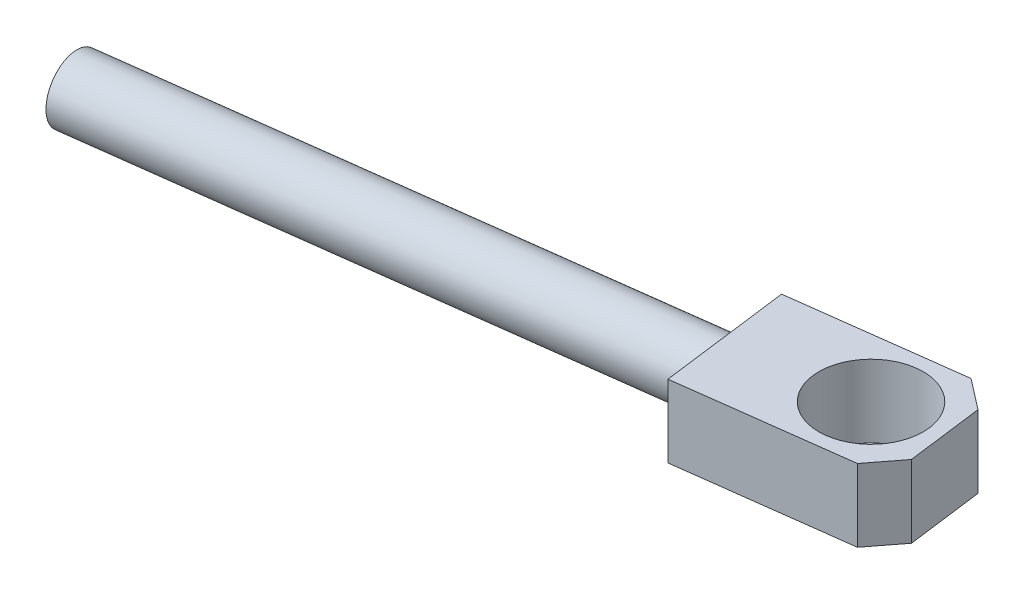
ISO-10303-21;
HEADER;
FILE_DESCRIPTION(('STEP AP214'),'2;1');
FILE_NAME('part.step','',(''),(''),'','','');
FILE_SCHEMA(('AUTOMOTIVE_DESIGN { 1 0 10303 214 1 1 1 1 }'));
ENDSEC;
DATA;
#1=APPLICATION_CONTEXT('core data for automotive mechanical design processes');
#2=APPLICATION_PROTOCOL_DEFINITION('international standard','automotive_design',2000,#1);
#3=PRODUCT_CONTEXT('',#1,'mechanical');
#4=PRODUCT('Part','Part','',(#3));
#5=PRODUCT_RELATED_PRODUCT_CATEGORY('part','',(#4));
#6=PRODUCT_DEFINITION_FORMATION('','',#4);
#7=PRODUCT_DEFINITION_CONTEXT('part definition',#1,'design');
#8=PRODUCT_DEFINITION('design','',#6,#7);
#9=PRODUCT_DEFINITION_SHAPE('','',#8);
#10=(LENGTH_UNIT() NAMED_UNIT(*) SI_UNIT(.MILLI.,.METRE.));
#11=(NAMED_UNIT(*) PLANE_ANGLE_UNIT() SI_UNIT($,.RADIAN.));
#12=(NAMED_UNIT(*) SI_UNIT($,.STERADIAN.) SOLID_ANGLE_UNIT());
#13=UNCERTAINTY_MEASURE_WITH_UNIT(LENGTH_MEASURE(1.E-05),#10,'distance_accuracy_value','');
#14=(GEOMETRIC_REPRESENTATION_CONTEXT(3) GLOBAL_UNCERTAINTY_ASSIGNED_CONTEXT((#13)) GLOBAL_UNIT_ASSIGNED_CONTEXT((#10,
#11,#12)) REPRESENTATION_CONTEXT('',''));
#15=CARTESIAN_POINT('',(0.,0.,0.));
#16=DIRECTION('',(0.,0.,1.));
#17=DIRECTION('',(1.,0.,0.));
#18=AXIS2_PLACEMENT_3D('',#15,#16,#17);
#19=CARTESIAN_POINT('',(-485.084110851117,-266.42,1292.13122164463));
#20=DIRECTION('',(-0.991722729757381,0.,0.128397925538416));
#21=DIRECTION('',(0.128397925538416,0.,0.991722729757381));
#22=AXIS2_PLACEMENT_3D('',#19,#20,#21);
#23=PLANE('',#22);
#24=CARTESIAN_POINT('',(-480.536256328546,-231.,1327.25804073264));
#25=DIRECTION('',(-0.991722729757381,0.,0.128397925538415));
#26=DIRECTION('',(0.128397925538415,0.,0.991722729757381));
#27=AXIS2_PLACEMENT_3D('',#24,#25,#26);
#28=CIRCLE('',#27,35.0000000000011);
#29=CARTESIAN_POINT('',(-476.042328934701,-231.,1361.96833627415));
#30=VERTEX_POINT('',#29);
#31=EDGE_CURVE('E22',#30,#30,#28,.F.);
#32=ORIENTED_EDGE('',*,*,#31,.F.);
#33=EDGE_LOOP('',(#32));
#34=FACE_BOUND('',#33,.T.);
#35=ADVANCED_FACE('F18',(#34),#23,.T.);
#36=CARTESIAN_POINT('',(155.158013445956,-231.,1244.95497046251));
#37=DIRECTION('',(-0.991722729757381,0.,0.128397925538415));
#38=DIRECTION('',(0.128397925538415,0.,0.991722729757381));
#39=AXIS2_PLACEMENT_3D('',#36,#37,#38);
#40=CYLINDRICAL_SURFACE('',#39,35.0000000000011);
#41=CARTESIAN_POINT('',(155.158013445957,-231.,1244.95497046251));
#42=DIRECTION('',(-0.991722729757381,0.,0.128397925538415));
#43=DIRECTION('',(0.128397925538415,0.,0.991722729757381));
#44=AXIS2_PLACEMENT_3D('',#41,#42,#43);
#45=CIRCLE('',#44,35.0000000000011);
#46=CARTESIAN_POINT('',(159.651940839802,-231.,1279.66526600402));
#47=VERTEX_POINT('',#46);
#48=EDGE_CURVE('E126',#47,#47,#45,.F.);
#49=ORIENTED_EDGE('',*,*,#48,.F.);
#50=EDGE_LOOP('',(#49));
#51=FACE_BOUND('',#50,.T.);
#52=ORIENTED_EDGE('',*,*,#31,.T.);
#53=EDGE_LOOP('',(#52));
#54=FACE_BOUND('',#53,.T.);
#55=ADVANCED_FACE('F20',(#51,#54),#40,.T.);
#56=CARTESIAN_POINT('',(164.466863047492,-191.,1316.85486836992));
#57=DIRECTION('',(-0.991722729757381,0.,0.128397925538418));
#58=DIRECTION('',(-0.128397925538418,0.,-0.991722729757381));
#59=AXIS2_PLACEMENT_3D('',#56,#57,#58);
#60=PLANE('',#59);
#61=ORIENTED_EDGE('',*,*,#48,.T.);
#62=EDGE_LOOP('',(#61));
#63=FACE_BOUND('',#62,.T.);
#64=DIRECTION('',(0.128397925538415,0.,0.991722729757381));
#65=VECTOR('',#64,1.);
#66=CARTESIAN_POINT('',(145.849163844421,-271.,1173.0550725551));
#67=LINE('',#66,#65);
#68=CARTESIAN_POINT('',(164.466863047492,-271.,1316.85486836992));
#69=VERTEX_POINT('',#68);
#70=CARTESIAN_POINT('',(145.849163844421,-271.,1173.0550725551));
#71=VERTEX_POINT('',#70);
#72=EDGE_CURVE('E90',#69,#71,#67,.F.);
#73=ORIENTED_EDGE('',*,*,#72,.F.);
#74=DIRECTION('',(0.,-1.,0.));
#75=VECTOR('',#74,1.);
#76=CARTESIAN_POINT('',(164.466863047492,-191.,1316.85486836992));
#77=LINE('',#76,#75);
#78=CARTESIAN_POINT('',(164.466863047492,-191.,1316.85486836992));
#79=VERTEX_POINT('',#78);
#80=EDGE_CURVE('E68',#79,#69,#77,.T.);
#81=ORIENTED_EDGE('',*,*,#80,.F.);
#82=DIRECTION('',(0.128397925538415,0.,0.991722729757381));
#83=VECTOR('',#82,1.);
#84=CARTESIAN_POINT('',(145.849163844421,-191.,1173.0550725551));
#85=LINE('',#84,#83);
#86=CARTESIAN_POINT('',(145.849163844421,-191.,1173.0550725551));
#87=VERTEX_POINT('',#86);
#88=EDGE_CURVE('E72',#87,#79,#85,.T.);
#89=ORIENTED_EDGE('',*,*,#88,.F.);
#90=DIRECTION('',(0.,1.,0.));
#91=VECTOR('',#90,1.);
#92=CARTESIAN_POINT('',(145.849163844421,-271.,1173.0550725551));
#93=LINE('',#92,#91);
#94=EDGE_CURVE('E75',#71,#87,#93,.T.);
#95=ORIENTED_EDGE('',*,*,#94,.F.);
#96=EDGE_LOOP('',(#73,#81,#89,#95));
#97=FACE_BOUND('',#96,.T.);
#98=ADVANCED_FACE('F74',(#63,#97),#60,.T.);
#99=CARTESIAN_POINT('',(349.423152147248,-191.,1292.90865525701));
#100=DIRECTION('',(0.128397925538416,0.,0.991722729757381));
#101=DIRECTION('',(-0.991722729757381,0.,0.128397925538416));
#102=AXIS2_PLACEMENT_3D('',#99,#100,#101);
#103=PLANE('',#102);
#104=DIRECTION('',(0.991722729757381,0.,-0.128397925538415));
#105=VECTOR('',#104,1.);
#106=CARTESIAN_POINT('',(164.466863047492,-271.,1316.85486836992));
#107=LINE('',#106,#105);
#108=CARTESIAN_POINT('',(349.423152147247,-271.,1292.90865525701));
#109=VERTEX_POINT('',#108);
#110=EDGE_CURVE('E81',#109,#69,#107,.F.);
#111=ORIENTED_EDGE('',*,*,#110,.F.);
#112=DIRECTION('',(0.,-1.,0.));
#113=VECTOR('',#112,1.);
#114=CARTESIAN_POINT('',(349.423152147247,-191.,1292.90865525701));
#115=LINE('',#114,#113);
#116=CARTESIAN_POINT('',(349.423152147247,-191.,1292.90865525701));
#117=VERTEX_POINT('',#116);
#118=EDGE_CURVE('E124',#117,#109,#115,.T.);
#119=ORIENTED_EDGE('',*,*,#118,.F.);
#120=DIRECTION('',(-0.991722729757381,0.,0.128397925538415));
#121=VECTOR('',#120,1.);
#122=CARTESIAN_POINT('',(379.17483403997,-191.,1289.05671749085));
#123=LINE('',#122,#121);
#124=EDGE_CURVE('E80',#79,#117,#123,.F.);
#125=ORIENTED_EDGE('',*,*,#124,.F.);
#126=ORIENTED_EDGE('',*,*,#80,.T.);
#127=EDGE_LOOP('',(#111,#119,#125,#126));
#128=FACE_BOUND('',#127,.T.);
#129=ADVANCED_FACE('F168',(#128),#103,.T.);
#130=CARTESIAN_POINT('',(375.322896273817,-191.,1259.30503559813));
#131=DIRECTION('',(0.792044911106776,0.,0.610462823429781));
#132=DIRECTION('',(-0.610462823429781,0.,0.792044911106776));
#133=AXIS2_PLACEMENT_3D('',#130,#131,#132);
#134=PLANE('',#133);
#135=DIRECTION('',(-0.610462823429782,0.,0.792044911106775));
#136=VECTOR('',#135,1.);
#137=CARTESIAN_POINT('',(375.322896273817,-271.,1259.30503559813));
#138=LINE('',#137,#136);
#139=CARTESIAN_POINT('',(375.322896273817,-271.,1259.30503559813));
#140=VERTEX_POINT('',#139);
#141=EDGE_CURVE('E108',#140,#109,#138,.T.);
#142=ORIENTED_EDGE('',*,*,#141,.F.);
#143=DIRECTION('',(0.,-1.,0.));
#144=VECTOR('',#143,1.);
#145=CARTESIAN_POINT('',(375.322896273817,-191.,1259.30503559813));
#146=LINE('',#145,#144);
#147=CARTESIAN_POINT('',(375.322896273817,-191.,1259.30503559813));
#148=VERTEX_POINT('',#147);
#149=EDGE_CURVE('E122',#148,#140,#146,.T.);
#150=ORIENTED_EDGE('',*,*,#149,.F.);
#151=DIRECTION('',(0.610462823429781,0.,-0.792044911106776));
#152=VECTOR('',#151,1.);
#153=CARTESIAN_POINT('',(349.423152147247,-191.,1292.90865525701));
#154=LINE('',#153,#152);
#155=EDGE_CURVE('E102',#117,#148,#154,.T.);
#156=ORIENTED_EDGE('',*,*,#155,.F.);
#157=ORIENTED_EDGE('',*,*,#118,.T.);
#158=EDGE_LOOP('',(#142,#150,#156,#157));
#159=FACE_BOUND('',#158,.T.);
#160=ADVANCED_FACE('F164',(#159),#134,.T.);
#161=CARTESIAN_POINT('',(364.409072603051,-191.,1175.00860356875));
#162=DIRECTION('',(0.991722729757381,0.,-0.128397925538417));
#163=DIRECTION('',(0.128397925538417,0.,0.991722729757381));
#164=AXIS2_PLACEMENT_3D('',#161,#162,#163);
#165=PLANE('',#164);
#166=DIRECTION('',(0.128397925538415,0.,0.991722729757381));
#167=VECTOR('',#166,1.);
#168=CARTESIAN_POINT('',(360.557134836899,-271.,1145.25692167603));
#169=LINE('',#168,#167);
#170=CARTESIAN_POINT('',(364.409072603051,-271.,1175.00860356875));
#171=VERTEX_POINT('',#170);
#172=EDGE_CURVE('E111',#171,#140,#169,.T.);
#173=ORIENTED_EDGE('',*,*,#172,.F.);
#174=DIRECTION('',(0.,-1.,0.));
#175=VECTOR('',#174,1.);
#176=CARTESIAN_POINT('',(364.409072603051,-191.,1175.00860356875));
#177=LINE('',#176,#175);
#178=CARTESIAN_POINT('',(364.409072603051,-191.,1175.00860356875));
#179=VERTEX_POINT('',#178);
#180=EDGE_CURVE('E120',#179,#171,#177,.T.);
#181=ORIENTED_EDGE('',*,*,#180,.F.);
#182=DIRECTION('',(0.128397925538415,0.,0.991722729757381));
#183=VECTOR('',#182,1.);
#184=CARTESIAN_POINT('',(360.557134836899,-191.,1145.25692167603));
#185=LINE('',#184,#183);
#186=EDGE_CURVE('E98',#148,#179,#185,.F.);
#187=ORIENTED_EDGE('',*,*,#186,.F.);
#188=ORIENTED_EDGE('',*,*,#149,.T.);
#189=EDGE_LOOP('',(#173,#181,#187,#188));
#190=FACE_BOUND('',#189,.T.);
#191=ADVANCED_FACE('F161',(#190),#165,.T.);
#192=CARTESIAN_POINT('',(330.805452944177,-191.,1149.10885944218));
#193=DIRECTION('',(0.610462823429776,0.,-0.79204491110678));
#194=DIRECTION('',(0.79204491110678,0.,0.610462823429776));
#195=AXIS2_PLACEMENT_3D('',#192,#193,#194);
#196=PLANE('',#195);
#197=DIRECTION('',(0.792044911106778,0.,0.610462823429778));
#198=VECTOR('',#197,1.);
#199=CARTESIAN_POINT('',(330.805452944177,-271.,1149.10885944218));
#200=LINE('',#199,#198);
#201=CARTESIAN_POINT('',(330.805452944177,-271.,1149.10885944218));
#202=VERTEX_POINT('',#201);
#203=EDGE_CURVE('E114',#202,#171,#200,.T.);
#204=ORIENTED_EDGE('',*,*,#203,.F.);
#205=DIRECTION('',(0.,1.,0.));
#206=VECTOR('',#205,1.);
#207=CARTESIAN_POINT('',(330.805452944177,-271.,1149.10885944218));
#208=LINE('',#207,#206);
#209=CARTESIAN_POINT('',(330.805452944177,-191.,1149.10885944218));
#210=VERTEX_POINT('',#209);
#211=EDGE_CURVE('E37',#210,#202,#208,.F.);
#212=ORIENTED_EDGE('',*,*,#211,.F.);
#213=DIRECTION('',(-0.792044911106779,0.,-0.610462823429777));
#214=VECTOR('',#213,1.);
#215=CARTESIAN_POINT('',(364.409072603051,-191.,1175.00860356875));
#216=LINE('',#215,#214);
#217=EDGE_CURVE('E94',#179,#210,#216,.T.);
#218=ORIENTED_EDGE('',*,*,#217,.F.);
#219=ORIENTED_EDGE('',*,*,#180,.T.);
#220=EDGE_LOOP('',(#204,#212,#218,#219));
#221=FACE_BOUND('',#220,.T.);
#222=ADVANCED_FACE('F158',(#221),#196,.T.);
#223=CARTESIAN_POINT('',(145.849163844421,-271.,1173.0550725551));
#224=DIRECTION('',(-0.128397925538416,0.,-0.991722729757381));
#225=DIRECTION('',(0.,1.,0.));
#226=AXIS2_PLACEMENT_3D('',#223,#224,#225);
#227=PLANE('',#226);
#228=DIRECTION('',(0.991722729757381,0.,-0.128397925538415));
#229=VECTOR('',#228,1.);
#230=CARTESIAN_POINT('',(145.849163844421,-271.,1173.0550725551));
#231=LINE('',#230,#229);
#232=EDGE_CURVE('E88',#71,#202,#231,.T.);
#233=ORIENTED_EDGE('',*,*,#232,.F.);
#234=ORIENTED_EDGE('',*,*,#94,.T.);
#235=DIRECTION('',(-0.991722729757381,0.,0.128397925538415));
#236=VECTOR('',#235,1.);
#237=CARTESIAN_POINT('',(360.557134836899,-191.,1145.25692167603));
#238=LINE('',#237,#236);
#239=EDGE_CURVE('E85',#210,#87,#238,.T.);
#240=ORIENTED_EDGE('',*,*,#239,.F.);
#241=ORIENTED_EDGE('',*,*,#211,.T.);
#242=EDGE_LOOP('',(#233,#234,#240,#241));
#243=FACE_BOUND('',#242,.T.);
#244=ADVANCED_FACE('F84',(#243),#227,.T.);
#245=CARTESIAN_POINT('',(145.849163844421,-271.,1173.0550725551));
#246=DIRECTION('',(0.,-1.,0.));
#247=DIRECTION('',(0.991722729757381,0.,-0.128397925538415));
#248=AXIS2_PLACEMENT_3D('',#245,#246,#247);
#249=PLANE('',#248);
#250=CARTESIAN_POINT('',(297.966086531023,-271.,1226.46566918498));
#251=DIRECTION('',(0.,1.,0.));
#252=DIRECTION('',(0.,0.,1.));
#253=AXIS2_PLACEMENT_3D('',#250,#251,#252);
#254=CIRCLE('',#253,57.5000000000011);
#255=CARTESIAN_POINT('',(297.966086531023,-271.,1283.96566918498));
#256=VERTEX_POINT('',#255);
#257=EDGE_CURVE('E28',#256,#256,#254,.F.);
#258=ORIENTED_EDGE('',*,*,#257,.F.);
#259=EDGE_LOOP('',(#258));
#260=FACE_BOUND('',#259,.T.);
#261=ORIENTED_EDGE('',*,*,#141,.T.);
#262=ORIENTED_EDGE('',*,*,#110,.T.);
#263=ORIENTED_EDGE('',*,*,#72,.T.);
#264=ORIENTED_EDGE('',*,*,#232,.T.);
#265=ORIENTED_EDGE('',*,*,#203,.T.);
#266=ORIENTED_EDGE('',*,*,#172,.T.);
#267=EDGE_LOOP('',(#261,#262,#263,#264,#265,#266));
#268=FACE_BOUND('',#267,.T.);
#269=ADVANCED_FACE('F148',(#260,#268),#249,.T.);
#270=CARTESIAN_POINT('',(360.557134836899,-191.,1145.25692167603));
#271=DIRECTION('',(0.,1.,0.));
#272=DIRECTION('',(-0.991722729757381,0.,0.128397925538415));
#273=AXIS2_PLACEMENT_3D('',#270,#271,#272);
#274=PLANE('',#273);
#275=CARTESIAN_POINT('',(297.966086531023,-191.,1226.46566918498));
#276=DIRECTION('',(0.,1.,0.));
#277=DIRECTION('',(0.,0.,1.));
#278=AXIS2_PLACEMENT_3D('',#275,#276,#277);
#279=CIRCLE('',#278,57.5000000000011);
#280=CARTESIAN_POINT('',(297.966086531023,-191.,1283.96566918498));
#281=VERTEX_POINT('',#280);
#282=EDGE_CURVE('E11',#281,#281,#279,.T.);
#283=ORIENTED_EDGE('',*,*,#282,.F.);
#284=EDGE_LOOP('',(#283));
#285=FACE_BOUND('',#284,.T.);
#286=ORIENTED_EDGE('',*,*,#217,.T.);
#287=ORIENTED_EDGE('',*,*,#239,.T.);
#288=ORIENTED_EDGE('',*,*,#88,.T.);
#289=ORIENTED_EDGE('',*,*,#124,.T.);
#290=ORIENTED_EDGE('',*,*,#155,.T.);
#291=ORIENTED_EDGE('',*,*,#186,.T.);
#292=EDGE_LOOP('',(#286,#287,#288,#289,#290,#291));
#293=FACE_BOUND('',#292,.T.);
#294=ADVANCED_FACE('F92',(#285,#293),#274,.T.);
#295=CARTESIAN_POINT('',(297.966086531023,-271.,1226.46566918498));
#296=DIRECTION('',(0.,1.,0.));
#297=DIRECTION('',(0.,0.,1.));
#298=AXIS2_PLACEMENT_3D('',#295,#296,#297);
#299=CYLINDRICAL_SURFACE('',#298,57.5000000000011);
#300=ORIENTED_EDGE('',*,*,#282,.T.);
#301=EDGE_LOOP('',(#300));
#302=FACE_BOUND('',#301,.T.);
#303=ORIENTED_EDGE('',*,*,#257,.T.);
#304=EDGE_LOOP('',(#303));
#305=FACE_BOUND('',#304,.T.);
#306=ADVANCED_FACE('F142',(#302,#305),#299,.F.);
#307=CLOSED_SHELL('',(#35,#55,#98,#129,#160,#191,#222,#244,#269,#294,#306));
#308=MANIFOLD_SOLID_BREP('B1',#307);
#309=ADVANCED_BREP_SHAPE_REPRESENTATION('',(#18,#308),#14);
#310=SHAPE_DEFINITION_REPRESENTATION(#9,#309);
ENDSEC;
END-ISO-10303-21;
